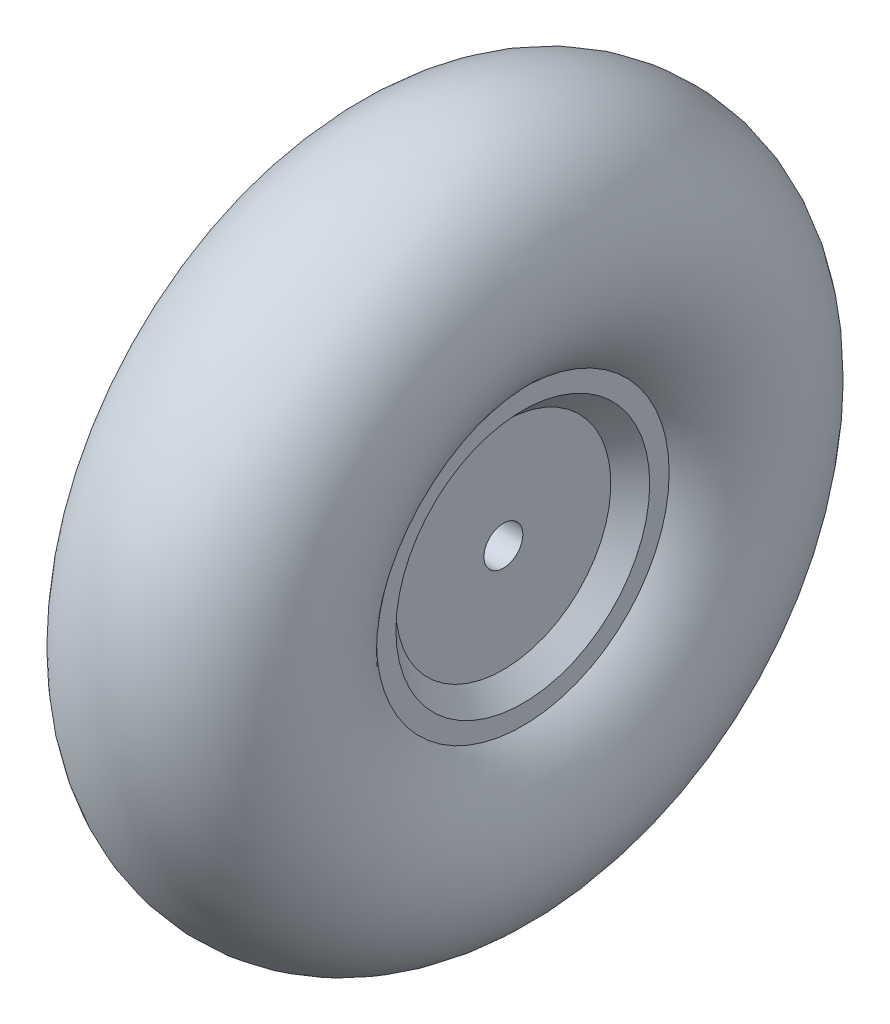
ISO-10303-21;
HEADER;
FILE_DESCRIPTION(('STEP AP214'),'2;1');
FILE_NAME('part.step','',(''),(''),'','','');
FILE_SCHEMA(('AUTOMOTIVE_DESIGN { 1 0 10303 214 1 1 1 1 }'));
ENDSEC;
DATA;
#1=APPLICATION_CONTEXT('core data for automotive mechanical design processes');
#2=APPLICATION_PROTOCOL_DEFINITION('international standard','automotive_design',2000,#1);
#3=PRODUCT_CONTEXT('',#1,'mechanical');
#4=PRODUCT('Part','Part','',(#3));
#5=PRODUCT_RELATED_PRODUCT_CATEGORY('part','',(#4));
#6=PRODUCT_DEFINITION_FORMATION('','',#4);
#7=PRODUCT_DEFINITION_CONTEXT('part definition',#1,'design');
#8=PRODUCT_DEFINITION('design','',#6,#7);
#9=PRODUCT_DEFINITION_SHAPE('','',#8);
#10=(LENGTH_UNIT() NAMED_UNIT(*) SI_UNIT(.MILLI.,.METRE.));
#11=(NAMED_UNIT(*) PLANE_ANGLE_UNIT() SI_UNIT($,.RADIAN.));
#12=(NAMED_UNIT(*) SI_UNIT($,.STERADIAN.) SOLID_ANGLE_UNIT());
#13=UNCERTAINTY_MEASURE_WITH_UNIT(LENGTH_MEASURE(1.E-05),#10,'distance_accuracy_value','');
#14=(GEOMETRIC_REPRESENTATION_CONTEXT(3) GLOBAL_UNCERTAINTY_ASSIGNED_CONTEXT((#13)) GLOBAL_UNIT_ASSIGNED_CONTEXT((#10,
#11,#12)) REPRESENTATION_CONTEXT('',''));
#15=CARTESIAN_POINT('',(0.,0.,0.));
#16=DIRECTION('',(0.,0.,1.));
#17=DIRECTION('',(1.,0.,0.));
#18=AXIS2_PLACEMENT_3D('',#15,#16,#17);
#19=CARTESIAN_POINT('',(0.,0.,0.));
#20=DIRECTION('',(-1.,0.,0.));
#21=DIRECTION('',(0.,0.,1.));
#22=AXIS2_PLACEMENT_3D('',#19,#20,#21);
#23=TOROIDAL_SURFACE('',#22,38.1,19.05);
#24=CARTESIAN_POINT('',(12.7,0.,0.));
#25=DIRECTION('',(-1.,0.,0.));
#26=DIRECTION('',(0.,0.,1.));
#27=AXIS2_PLACEMENT_3D('',#24,#25,#26);
#28=CIRCLE('',#27,23.9009683428763);
#29=CARTESIAN_POINT('',(12.7,0.,23.9009683428763));
#30=VERTEX_POINT('',#29);
#31=EDGE_CURVE('E78',#30,#30,#28,.T.);
#32=ORIENTED_EDGE('',*,*,#31,.T.);
#33=EDGE_LOOP('',(#32));
#34=FACE_BOUND('',#33,.T.);
#35=CARTESIAN_POINT('',(-12.7,0.,0.));
#36=DIRECTION('',(-1.,0.,0.));
#37=DIRECTION('',(0.,0.,1.));
#38=AXIS2_PLACEMENT_3D('',#35,#36,#37);
#39=CIRCLE('',#38,23.9009683428763);
#40=CARTESIAN_POINT('',(-12.7,0.,23.9009683428763));
#41=VERTEX_POINT('',#40);
#42=EDGE_CURVE('E10',#41,#41,#39,.T.);
#43=ORIENTED_EDGE('',*,*,#42,.F.);
#44=EDGE_LOOP('',(#43));
#45=FACE_BOUND('',#44,.T.);
#46=ADVANCED_FACE('F43',(#34,#45),#23,.T.);
#47=CARTESIAN_POINT('',(-12.7,0.,0.));
#48=DIRECTION('',(1.,0.,0.));
#49=DIRECTION('',(0.,0.,-1.));
#50=AXIS2_PLACEMENT_3D('',#47,#48,#49);
#51=PLANE('',#50);
#52=CARTESIAN_POINT('',(-12.7,0.,0.));
#53=DIRECTION('',(-1.,0.,0.));
#54=DIRECTION('',(0.,0.,1.));
#55=AXIS2_PLACEMENT_3D('',#52,#53,#54);
#56=CIRCLE('',#55,20.7259683428763);
#57=CARTESIAN_POINT('',(-12.7,0.,20.7259683428763));
#58=VERTEX_POINT('',#57);
#59=EDGE_CURVE('E50',#58,#58,#56,.T.);
#60=ORIENTED_EDGE('',*,*,#59,.F.);
#61=EDGE_LOOP('',(#60));
#62=FACE_BOUND('',#61,.T.);
#63=ORIENTED_EDGE('',*,*,#42,.T.);
#64=EDGE_LOOP('',(#63));
#65=FACE_BOUND('',#64,.T.);
#66=ADVANCED_FACE('F97',(#62,#65),#51,.F.);
#67=CARTESIAN_POINT('',(-12.7,0.,0.));
#68=DIRECTION('',(-1.,0.,0.));
#69=DIRECTION('',(0.,0.,1.));
#70=AXIS2_PLACEMENT_3D('',#67,#68,#69);
#71=CONICAL_SURFACE('',#70,20.7259683428763,0.785398163397446);
#72=CARTESIAN_POINT('',(-9.525,0.,0.));
#73=DIRECTION('',(-1.,0.,0.));
#74=DIRECTION('',(0.,0.,1.));
#75=AXIS2_PLACEMENT_3D('',#72,#73,#74);
#76=CIRCLE('',#75,17.5509683428763);
#77=CARTESIAN_POINT('',(-9.525,0.,17.5509683428763));
#78=VERTEX_POINT('',#77);
#79=EDGE_CURVE('E55',#78,#78,#76,.T.);
#80=ORIENTED_EDGE('',*,*,#79,.F.);
#81=EDGE_LOOP('',(#80));
#82=FACE_BOUND('',#81,.T.);
#83=ORIENTED_EDGE('',*,*,#59,.T.);
#84=EDGE_LOOP('',(#83));
#85=FACE_BOUND('',#84,.T.);
#86=ADVANCED_FACE('F101',(#82,#85),#71,.F.);
#87=CARTESIAN_POINT('',(-9.525,0.,0.));
#88=DIRECTION('',(1.,0.,0.));
#89=DIRECTION('',(0.,0.,-1.));
#90=AXIS2_PLACEMENT_3D('',#87,#88,#89);
#91=PLANE('',#90);
#92=CARTESIAN_POINT('',(-9.52499999999999,0.,0.));
#93=DIRECTION('',(-1.,0.,0.));
#94=DIRECTION('',(0.,0.,1.));
#95=AXIS2_PLACEMENT_3D('',#92,#93,#94);
#96=CIRCLE('',#95,3.175);
#97=CARTESIAN_POINT('',(-9.52499999999999,0.,3.175));
#98=VERTEX_POINT('',#97);
#99=EDGE_CURVE('E60',#98,#98,#96,.T.);
#100=ORIENTED_EDGE('',*,*,#99,.F.);
#101=EDGE_LOOP('',(#100));
#102=FACE_BOUND('',#101,.T.);
#103=ORIENTED_EDGE('',*,*,#79,.T.);
#104=EDGE_LOOP('',(#103));
#105=FACE_BOUND('',#104,.T.);
#106=ADVANCED_FACE('F106',(#102,#105),#91,.F.);
#107=CARTESIAN_POINT('',(-53.5069864975477,0.,0.));
#108=DIRECTION('',(-1.,0.,0.));
#109=DIRECTION('',(0.,0.,1.));
#110=AXIS2_PLACEMENT_3D('',#107,#108,#109);
#111=CYLINDRICAL_SURFACE('',#110,3.175);
#112=ORIENTED_EDGE('',*,*,#99,.T.);
#113=EDGE_LOOP('',(#112));
#114=FACE_BOUND('',#113,.T.);
#115=CARTESIAN_POINT('',(9.52500000000001,0.,0.));
#116=DIRECTION('',(-1.,0.,0.));
#117=DIRECTION('',(0.,0.,1.));
#118=AXIS2_PLACEMENT_3D('',#115,#116,#117);
#119=CIRCLE('',#118,3.175);
#120=CARTESIAN_POINT('',(9.52500000000001,0.,3.175));
#121=VERTEX_POINT('',#120);
#122=EDGE_CURVE('E66',#121,#121,#119,.T.);
#123=ORIENTED_EDGE('',*,*,#122,.F.);
#124=EDGE_LOOP('',(#123));
#125=FACE_BOUND('',#124,.T.);
#126=ADVANCED_FACE('F112',(#114,#125),#111,.F.);
#127=CARTESIAN_POINT('',(9.525,0.,0.));
#128=DIRECTION('',(1.,0.,0.));
#129=DIRECTION('',(0.,0.,-1.));
#130=AXIS2_PLACEMENT_3D('',#127,#128,#129);
#131=PLANE('',#130);
#132=ORIENTED_EDGE('',*,*,#122,.T.);
#133=EDGE_LOOP('',(#132));
#134=FACE_BOUND('',#133,.T.);
#135=CARTESIAN_POINT('',(9.52500000000001,0.,0.));
#136=DIRECTION('',(-1.,0.,0.));
#137=DIRECTION('',(0.,0.,1.));
#138=AXIS2_PLACEMENT_3D('',#135,#136,#137);
#139=CIRCLE('',#138,17.5509683428763);
#140=CARTESIAN_POINT('',(9.52500000000001,0.,17.5509683428763));
#141=VERTEX_POINT('',#140);
#142=EDGE_CURVE('E70',#141,#141,#139,.T.);
#143=ORIENTED_EDGE('',*,*,#142,.F.);
#144=EDGE_LOOP('',(#143));
#145=FACE_BOUND('',#144,.T.);
#146=ADVANCED_FACE('F93',(#134,#145),#131,.T.);
#147=CARTESIAN_POINT('',(12.7,0.,0.));
#148=DIRECTION('',(1.,0.,0.));
#149=DIRECTION('',(0.,0.,-1.));
#150=AXIS2_PLACEMENT_3D('',#147,#148,#149);
#151=CONICAL_SURFACE('',#150,20.7259683428763,0.785398163397447);
#152=ORIENTED_EDGE('',*,*,#142,.T.);
#153=EDGE_LOOP('',(#152));
#154=FACE_BOUND('',#153,.T.);
#155=CARTESIAN_POINT('',(12.7,0.,0.));
#156=DIRECTION('',(-1.,0.,0.));
#157=DIRECTION('',(0.,0.,1.));
#158=AXIS2_PLACEMENT_3D('',#155,#156,#157);
#159=CIRCLE('',#158,20.7259683428763);
#160=CARTESIAN_POINT('',(12.7,0.,20.7259683428763));
#161=VERTEX_POINT('',#160);
#162=EDGE_CURVE('E74',#161,#161,#159,.T.);
#163=ORIENTED_EDGE('',*,*,#162,.F.);
#164=EDGE_LOOP('',(#163));
#165=FACE_BOUND('',#164,.T.);
#166=ADVANCED_FACE('F87',(#154,#165),#151,.F.);
#167=CARTESIAN_POINT('',(12.7,0.,0.));
#168=DIRECTION('',(1.,0.,0.));
#169=DIRECTION('',(0.,0.,-1.));
#170=AXIS2_PLACEMENT_3D('',#167,#168,#169);
#171=PLANE('',#170);
#172=ORIENTED_EDGE('',*,*,#162,.T.);
#173=EDGE_LOOP('',(#172));
#174=FACE_BOUND('',#173,.T.);
#175=ORIENTED_EDGE('',*,*,#31,.F.);
#176=EDGE_LOOP('',(#175));
#177=FACE_BOUND('',#176,.T.);
#178=ADVANCED_FACE('F85',(#174,#177),#171,.T.);
#179=CLOSED_SHELL('',(#46,#66,#86,#106,#126,#146,#166,#178));
#180=MANIFOLD_SOLID_BREP('B2',#179);
#181=ADVANCED_BREP_SHAPE_REPRESENTATION('',(#18,#180),#14);
#182=SHAPE_DEFINITION_REPRESENTATION(#9,#181);
ENDSEC;
END-ISO-10303-21;
